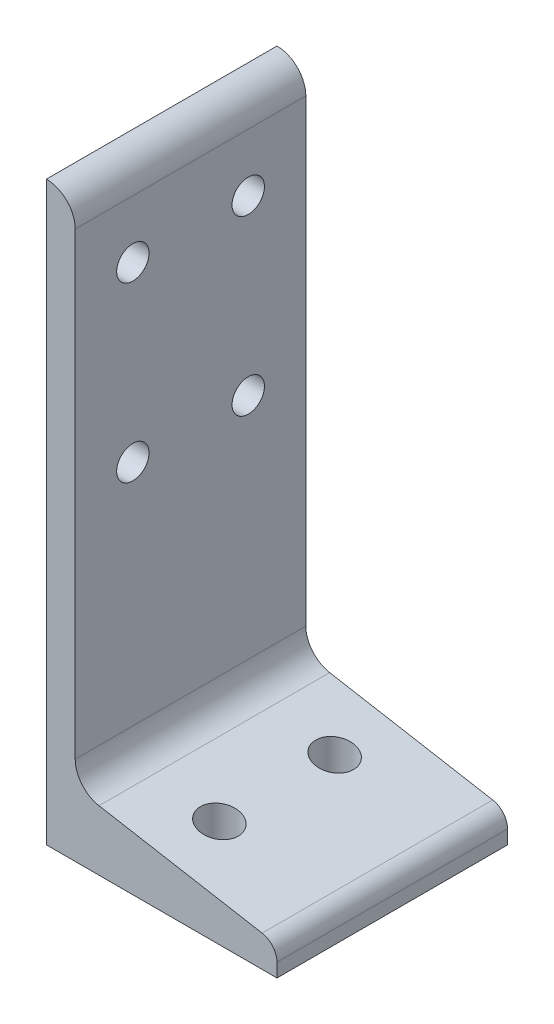
ISO-10303-21;
HEADER;
FILE_DESCRIPTION(('STEP AP214'),'2;1');
FILE_NAME('part.step','',(''),(''),'','','');
FILE_SCHEMA(('AUTOMOTIVE_DESIGN { 1 0 10303 214 1 1 1 1 }'));
ENDSEC;
DATA;
#1=APPLICATION_CONTEXT('core data for automotive mechanical design processes');
#2=APPLICATION_PROTOCOL_DEFINITION('international standard','automotive_design',2000,#1);
#3=PRODUCT_CONTEXT('',#1,'mechanical');
#4=PRODUCT('Part','Part','',(#3));
#5=PRODUCT_RELATED_PRODUCT_CATEGORY('part','',(#4));
#6=PRODUCT_DEFINITION_FORMATION('','',#4);
#7=PRODUCT_DEFINITION_CONTEXT('part definition',#1,'design');
#8=PRODUCT_DEFINITION('design','',#6,#7);
#9=PRODUCT_DEFINITION_SHAPE('','',#8);
#10=(LENGTH_UNIT() NAMED_UNIT(*) SI_UNIT(.MILLI.,.METRE.));
#11=(NAMED_UNIT(*) PLANE_ANGLE_UNIT() SI_UNIT($,.RADIAN.));
#12=(NAMED_UNIT(*) SI_UNIT($,.STERADIAN.) SOLID_ANGLE_UNIT());
#13=UNCERTAINTY_MEASURE_WITH_UNIT(LENGTH_MEASURE(1.E-05),#10,'distance_accuracy_value','');
#14=(GEOMETRIC_REPRESENTATION_CONTEXT(3) GLOBAL_UNCERTAINTY_ASSIGNED_CONTEXT((#13)) GLOBAL_UNIT_ASSIGNED_CONTEXT((#10,
#11,#12)) REPRESENTATION_CONTEXT('',''));
#15=CARTESIAN_POINT('',(0.,0.,0.));
#16=DIRECTION('',(0.,0.,1.));
#17=DIRECTION('',(1.,0.,0.));
#18=AXIS2_PLACEMENT_3D('',#15,#16,#17);
#19=CARTESIAN_POINT('',(-16.3878975119817,0.,50.8));
#20=DIRECTION('',(-1.,0.,0.));
#21=DIRECTION('',(0.,-1.,0.));
#22=AXIS2_PLACEMENT_3D('',#19,#20,#21);
#23=PLANE('',#22);
#24=CARTESIAN_POINT('',(-16.3878975119818,121.648995440178,12.6852380775335));
#25=DIRECTION('',(1.,0.,0.));
#26=DIRECTION('',(0.,1.,0.));
#27=AXIS2_PLACEMENT_3D('',#24,#25,#26);
#28=CIRCLE('',#27,3.56870000000001);
#29=CARTESIAN_POINT('',(-16.3878975119818,125.217695440178,12.6852380775335));
#30=VERTEX_POINT('',#29);
#31=EDGE_CURVE('E193',#30,#30,#28,.T.);
#32=ORIENTED_EDGE('',*,*,#31,.F.);
#33=EDGE_LOOP('',(#32));
#34=FACE_BOUND('',#33,.T.);
#35=CARTESIAN_POINT('',(-16.3878975119817,83.5489782815445,12.6852380775335));
#36=DIRECTION('',(1.,0.,0.));
#37=DIRECTION('',(0.,1.,0.));
#38=AXIS2_PLACEMENT_3D('',#35,#36,#37);
#39=CIRCLE('',#38,3.56869999999999);
#40=CARTESIAN_POINT('',(-16.3878975119817,87.1176782815445,12.6852380775335));
#41=VERTEX_POINT('',#40);
#42=EDGE_CURVE('E209',#41,#41,#39,.T.);
#43=ORIENTED_EDGE('',*,*,#42,.F.);
#44=EDGE_LOOP('',(#43));
#45=FACE_BOUND('',#44,.T.);
#46=CARTESIAN_POINT('',(-16.3878975119817,83.5489782815445,38.1));
#47=DIRECTION('',(1.,0.,0.));
#48=DIRECTION('',(0.,1.,0.));
#49=AXIS2_PLACEMENT_3D('',#46,#47,#48);
#50=CIRCLE('',#49,3.56869999999999);
#51=CARTESIAN_POINT('',(-16.3878975119817,87.1176782815445,38.1));
#52=VERTEX_POINT('',#51);
#53=EDGE_CURVE('E214',#52,#52,#50,.T.);
#54=ORIENTED_EDGE('',*,*,#53,.F.);
#55=EDGE_LOOP('',(#54));
#56=FACE_BOUND('',#55,.T.);
#57=CARTESIAN_POINT('',(-16.3878975119818,121.648978281545,38.1));
#58=DIRECTION('',(1.,0.,0.));
#59=DIRECTION('',(0.,1.,0.));
#60=AXIS2_PLACEMENT_3D('',#57,#58,#59);
#61=CIRCLE('',#60,3.56870000000002);
#62=CARTESIAN_POINT('',(-16.3878975119818,125.217678281545,38.1));
#63=VERTEX_POINT('',#62);
#64=EDGE_CURVE('E220',#63,#63,#61,.T.);
#65=ORIENTED_EDGE('',*,*,#64,.F.);
#66=EDGE_LOOP('',(#65));
#67=FACE_BOUND('',#66,.T.);
#68=DIRECTION('',(0.,1.,0.));
#69=VECTOR('',#68,1.);
#70=CARTESIAN_POINT('',(-16.3878975119817,0.,0.));
#71=LINE('',#70,#69);
#72=CARTESIAN_POINT('',(-16.3878975119817,33.2149952320115,0.));
#73=VERTEX_POINT('',#72);
#74=CARTESIAN_POINT('',(-16.3878975119818,134.348978281545,0.));
#75=VERTEX_POINT('',#74);
#76=EDGE_CURVE('E136',#73,#75,#71,.T.);
#77=ORIENTED_EDGE('',*,*,#76,.T.);
#78=DIRECTION('',(0.,0.,-1.));
#79=VECTOR('',#78,1.);
#80=CARTESIAN_POINT('',(-16.3878975119818,134.348978281545,50.8));
#81=LINE('',#80,#79);
#82=CARTESIAN_POINT('',(-16.3878975119818,134.348978281545,50.8));
#83=VERTEX_POINT('',#82);
#84=EDGE_CURVE('E11',#83,#75,#81,.T.);
#85=ORIENTED_EDGE('',*,*,#84,.F.);
#86=DIRECTION('',(0.,1.,0.));
#87=VECTOR('',#86,1.);
#88=CARTESIAN_POINT('',(-16.3878975119817,0.,50.8));
#89=LINE('',#88,#87);
#90=CARTESIAN_POINT('',(-16.3878975119817,33.2149952320115,50.8));
#91=VERTEX_POINT('',#90);
#92=EDGE_CURVE('E168',#91,#83,#89,.T.);
#93=ORIENTED_EDGE('',*,*,#92,.F.);
#94=DIRECTION('',(0.,0.,-1.));
#95=VECTOR('',#94,1.);
#96=CARTESIAN_POINT('',(-16.3878975119817,33.2149952320115,50.8));
#97=LINE('',#96,#95);
#98=EDGE_CURVE('E53',#91,#73,#97,.T.);
#99=ORIENTED_EDGE('',*,*,#98,.T.);
#100=EDGE_LOOP('',(#77,#85,#93,#99));
#101=FACE_BOUND('',#100,.T.);
#102=ADVANCED_FACE('F35',(#34,#45,#56,#67,#101),#23,.F.);
#103=CARTESIAN_POINT('',(-22.7378975119818,134.348978281545,50.8));
#104=DIRECTION('',(0.,0.,1.));
#105=DIRECTION('',(-1.,0.,0.));
#106=AXIS2_PLACEMENT_3D('',#103,#104,#105);
#107=ELLIPSE('',#106,6.35,6.34999999999999);
#108=DIRECTION('',(0.,0.,-1.));
#109=VECTOR('',#108,1.);
#110=SURFACE_OF_LINEAR_EXTRUSION('',#107,#109);
#111=CARTESIAN_POINT('',(-22.7378975119818,134.348978281545,0.));
#112=DIRECTION('',(0.,0.,1.));
#113=DIRECTION('',(-1.,0.,0.));
#114=AXIS2_PLACEMENT_3D('',#111,#112,#113);
#115=ELLIPSE('',#114,6.35,6.34999999999999);
#116=CARTESIAN_POINT('',(-22.7378975119817,140.698978281544,0.));
#117=VERTEX_POINT('',#116);
#118=EDGE_CURVE('E235',#75,#117,#115,.T.);
#119=ORIENTED_EDGE('',*,*,#118,.T.);
#120=DIRECTION('',(0.,0.,-1.));
#121=VECTOR('',#120,1.);
#122=CARTESIAN_POINT('',(-22.7378975119817,140.698978281544,50.8));
#123=LINE('',#122,#121);
#124=CARTESIAN_POINT('',(-22.7378975119817,140.698978281544,50.8));
#125=VERTEX_POINT('',#124);
#126=EDGE_CURVE('E44',#125,#117,#123,.T.);
#127=ORIENTED_EDGE('',*,*,#126,.F.);
#128=EDGE_CURVE('E92',#83,#125,#107,.T.);
#129=ORIENTED_EDGE('',*,*,#128,.F.);
#130=ORIENTED_EDGE('',*,*,#84,.T.);
#131=EDGE_LOOP('',(#119,#127,#129,#130));
#132=FACE_BOUND('',#131,.T.);
#133=ADVANCED_FACE('F160',(#132),#110,.F.);
#134=CARTESIAN_POINT('',(-22.7378975119817,0.,50.8));
#135=DIRECTION('',(1.,0.,0.));
#136=DIRECTION('',(0.,1.,0.));
#137=AXIS2_PLACEMENT_3D('',#134,#135,#136);
#138=PLANE('',#137);
#139=CARTESIAN_POINT('',(-22.7378975119818,121.648995440178,12.6852380775335));
#140=DIRECTION('',(1.,0.,0.));
#141=DIRECTION('',(0.,1.,0.));
#142=AXIS2_PLACEMENT_3D('',#139,#140,#141);
#143=CIRCLE('',#142,3.56870000000001);
#144=CARTESIAN_POINT('',(-22.7378975119818,125.217695440178,12.6852380775335));
#145=VERTEX_POINT('',#144);
#146=EDGE_CURVE('E198',#145,#145,#143,.T.);
#147=ORIENTED_EDGE('',*,*,#146,.T.);
#148=EDGE_LOOP('',(#147));
#149=FACE_BOUND('',#148,.T.);
#150=CARTESIAN_POINT('',(-22.7378975119818,83.5489782815445,12.6852380775335));
#151=DIRECTION('',(1.,0.,0.));
#152=DIRECTION('',(0.,1.,0.));
#153=AXIS2_PLACEMENT_3D('',#150,#151,#152);
#154=CIRCLE('',#153,3.56869999999999);
#155=CARTESIAN_POINT('',(-22.7378975119818,87.1176782815445,12.6852380775335));
#156=VERTEX_POINT('',#155);
#157=EDGE_CURVE('E211',#156,#156,#154,.T.);
#158=ORIENTED_EDGE('',*,*,#157,.T.);
#159=EDGE_LOOP('',(#158));
#160=FACE_BOUND('',#159,.T.);
#161=CARTESIAN_POINT('',(-22.7378975119818,83.5489782815445,38.1));
#162=DIRECTION('',(1.,0.,0.));
#163=DIRECTION('',(0.,1.,0.));
#164=AXIS2_PLACEMENT_3D('',#161,#162,#163);
#165=CIRCLE('',#164,3.56869999999999);
#166=CARTESIAN_POINT('',(-22.7378975119818,87.1176782815445,38.1));
#167=VERTEX_POINT('',#166);
#168=EDGE_CURVE('E217',#167,#167,#165,.T.);
#169=ORIENTED_EDGE('',*,*,#168,.T.);
#170=EDGE_LOOP('',(#169));
#171=FACE_BOUND('',#170,.T.);
#172=CARTESIAN_POINT('',(-22.7378975119818,121.648978281545,38.1));
#173=DIRECTION('',(1.,0.,0.));
#174=DIRECTION('',(0.,1.,0.));
#175=AXIS2_PLACEMENT_3D('',#172,#173,#174);
#176=CIRCLE('',#175,3.56870000000002);
#177=CARTESIAN_POINT('',(-22.7378975119818,125.217678281545,38.1));
#178=VERTEX_POINT('',#177);
#179=EDGE_CURVE('E223',#178,#178,#176,.T.);
#180=ORIENTED_EDGE('',*,*,#179,.T.);
#181=EDGE_LOOP('',(#180));
#182=FACE_BOUND('',#181,.T.);
#183=DIRECTION('',(0.,-1.,0.));
#184=VECTOR('',#183,1.);
#185=CARTESIAN_POINT('',(-22.7378975119817,0.,0.));
#186=LINE('',#185,#184);
#187=CARTESIAN_POINT('',(-22.7378975119817,13.6989782815445,0.));
#188=VERTEX_POINT('',#187);
#189=EDGE_CURVE('E236',#117,#188,#186,.T.);
#190=ORIENTED_EDGE('',*,*,#189,.T.);
#191=DIRECTION('',(0.,0.,-1.));
#192=VECTOR('',#191,1.);
#193=CARTESIAN_POINT('',(-22.7378975119817,13.6989782815445,50.8));
#194=LINE('',#193,#192);
#195=CARTESIAN_POINT('',(-22.7378975119817,13.6989782815445,50.8));
#196=VERTEX_POINT('',#195);
#197=EDGE_CURVE('E183',#196,#188,#194,.T.);
#198=ORIENTED_EDGE('',*,*,#197,.F.);
#199=DIRECTION('',(0.,-1.,0.));
#200=VECTOR('',#199,1.);
#201=CARTESIAN_POINT('',(-22.7378975119817,0.,50.8));
#202=LINE('',#201,#200);
#203=EDGE_CURVE('E167',#125,#196,#202,.T.);
#204=ORIENTED_EDGE('',*,*,#203,.F.);
#205=ORIENTED_EDGE('',*,*,#126,.T.);
#206=EDGE_LOOP('',(#190,#198,#204,#205));
#207=FACE_BOUND('',#206,.T.);
#208=ADVANCED_FACE('F157',(#149,#160,#171,#182,#207),#138,.F.);
#209=CARTESIAN_POINT('',(0.,13.6989782815445,50.8));
#210=DIRECTION('',(0.,1.,0.));
#211=DIRECTION('',(-1.,0.,0.));
#212=AXIS2_PLACEMENT_3D('',#209,#210,#211);
#213=PLANE('',#212);
#214=CARTESIAN_POINT('',(2.66210248801829,13.6989782815445,38.1));
#215=DIRECTION('',(0.,-1.,0.));
#216=DIRECTION('',(1.,0.,0.));
#217=AXIS2_PLACEMENT_3D('',#214,#215,#216);
#218=CIRCLE('',#217,4.1656);
#219=CARTESIAN_POINT('',(6.82770248801829,13.6989782815445,38.1));
#220=VERTEX_POINT('',#219);
#221=EDGE_CURVE('E205',#220,#220,#218,.T.);
#222=ORIENTED_EDGE('',*,*,#221,.F.);
#223=EDGE_LOOP('',(#222));
#224=FACE_BOUND('',#223,.T.);
#225=CARTESIAN_POINT('',(2.66210248801829,13.6989782815445,12.7));
#226=DIRECTION('',(0.,-1.,0.));
#227=DIRECTION('',(1.,0.,0.));
#228=AXIS2_PLACEMENT_3D('',#225,#226,#227);
#229=CIRCLE('',#228,4.1656);
#230=CARTESIAN_POINT('',(6.82770248801829,13.6989782815445,12.7));
#231=VERTEX_POINT('',#230);
#232=EDGE_CURVE('E194',#231,#231,#229,.T.);
#233=ORIENTED_EDGE('',*,*,#232,.F.);
#234=EDGE_LOOP('',(#233));
#235=FACE_BOUND('',#234,.T.);
#236=DIRECTION('',(1.,0.,0.));
#237=VECTOR('',#236,1.);
#238=CARTESIAN_POINT('',(0.,13.6989782815445,0.));
#239=LINE('',#238,#237);
#240=CARTESIAN_POINT('',(28.0621024880183,13.6989782815445,0.));
#241=VERTEX_POINT('',#240);
#242=EDGE_CURVE('E181',#188,#241,#239,.T.);
#243=ORIENTED_EDGE('',*,*,#242,.T.);
#244=DIRECTION('',(0.,0.,-1.));
#245=VECTOR('',#244,1.);
#246=CARTESIAN_POINT('',(28.0621024880183,13.6989782815445,50.8));
#247=LINE('',#246,#245);
#248=CARTESIAN_POINT('',(28.0621024880183,13.6989782815445,50.8));
#249=VERTEX_POINT('',#248);
#250=EDGE_CURVE('E179',#249,#241,#247,.T.);
#251=ORIENTED_EDGE('',*,*,#250,.F.);
#252=DIRECTION('',(1.,0.,0.));
#253=VECTOR('',#252,1.);
#254=CARTESIAN_POINT('',(0.,13.6989782815445,50.8));
#255=LINE('',#254,#253);
#256=EDGE_CURVE('E171',#196,#249,#255,.T.);
#257=ORIENTED_EDGE('',*,*,#256,.F.);
#258=ORIENTED_EDGE('',*,*,#197,.T.);
#259=EDGE_LOOP('',(#243,#251,#257,#258));
#260=FACE_BOUND('',#259,.T.);
#261=ADVANCED_FACE('F153',(#224,#235,#260),#213,.F.);
#262=CARTESIAN_POINT('',(28.0621024880183,0.,50.8));
#263=DIRECTION('',(-1.,0.,0.));
#264=DIRECTION('',(0.,-1.,0.));
#265=AXIS2_PLACEMENT_3D('',#262,#263,#264);
#266=PLANE('',#265);
#267=DIRECTION('',(0.,1.,0.));
#268=VECTOR('',#267,1.);
#269=CARTESIAN_POINT('',(28.0621024880183,0.,0.));
#270=LINE('',#269,#268);
#271=CARTESIAN_POINT('',(28.0621024880183,16.7241299029677,0.));
#272=VERTEX_POINT('',#271);
#273=EDGE_CURVE('E185',#241,#272,#270,.T.);
#274=ORIENTED_EDGE('',*,*,#273,.T.);
#275=DIRECTION('',(0.,0.,-1.));
#276=VECTOR('',#275,1.);
#277=CARTESIAN_POINT('',(28.0621024880183,16.7241299029677,50.8));
#278=LINE('',#277,#276);
#279=CARTESIAN_POINT('',(28.0621024880183,16.7241299029677,50.8));
#280=VERTEX_POINT('',#279);
#281=EDGE_CURVE('E126',#280,#272,#278,.T.);
#282=ORIENTED_EDGE('',*,*,#281,.F.);
#283=DIRECTION('',(0.,1.,0.));
#284=VECTOR('',#283,1.);
#285=CARTESIAN_POINT('',(28.0621024880183,0.,50.8));
#286=LINE('',#285,#284);
#287=EDGE_CURVE('E114',#249,#280,#286,.T.);
#288=ORIENTED_EDGE('',*,*,#287,.F.);
#289=ORIENTED_EDGE('',*,*,#250,.T.);
#290=EDGE_LOOP('',(#274,#282,#288,#289));
#291=FACE_BOUND('',#290,.T.);
#292=ADVANCED_FACE('F150',(#291),#266,.F.);
#293=CARTESIAN_POINT('',(24.0997024880183,16.7241299029677,50.8));
#294=DIRECTION('',(0.,0.,1.));
#295=DIRECTION('',(1.,0.,0.));
#296=AXIS2_PLACEMENT_3D('',#293,#294,#295);
#297=ELLIPSE('',#296,3.9624,3.9624);
#298=DIRECTION('',(0.,0.,-1.));
#299=VECTOR('',#298,1.);
#300=SURFACE_OF_LINEAR_EXTRUSION('',#297,#299);
#301=CARTESIAN_POINT('',(24.0997024880183,16.7241299029677,0.));
#302=DIRECTION('',(0.,0.,1.));
#303=DIRECTION('',(1.,0.,0.));
#304=AXIS2_PLACEMENT_3D('',#301,#302,#303);
#305=ELLIPSE('',#304,3.9624,3.9624);
#306=CARTESIAN_POINT('',(24.7877660272057,20.6263321435033,0.));
#307=VERTEX_POINT('',#306);
#308=EDGE_CURVE('E123',#272,#307,#305,.T.);
#309=ORIENTED_EDGE('',*,*,#308,.T.);
#310=DIRECTION('',(0.,0.,-1.));
#311=VECTOR('',#310,1.);
#312=CARTESIAN_POINT('',(24.7877660272057,20.6263321435033,50.8));
#313=LINE('',#312,#311);
#314=CARTESIAN_POINT('',(24.7877660272057,20.6263321435033,50.8));
#315=VERTEX_POINT('',#314);
#316=EDGE_CURVE('E120',#315,#307,#313,.T.);
#317=ORIENTED_EDGE('',*,*,#316,.F.);
#318=EDGE_CURVE('E107',#280,#315,#297,.T.);
#319=ORIENTED_EDGE('',*,*,#318,.F.);
#320=ORIENTED_EDGE('',*,*,#281,.T.);
#321=EDGE_LOOP('',(#309,#317,#319,#320));
#322=FACE_BOUND('',#321,.T.);
#323=ADVANCED_FACE('F121',(#322),#300,.F.);
#324=CARTESIAN_POINT('',(4.27475314083834,24.2433297709902,50.8));
#325=DIRECTION('',(-0.17364817766693,-0.984807753012208,0.));
#326=DIRECTION('',(0.984807753012208,-0.17364817766693,0.));
#327=AXIS2_PLACEMENT_3D('',#324,#325,#326);
#328=PLANE('',#327);
#329=CARTESIAN_POINT('',(2.66210248801829,24.5276835915395,38.1));
#330=DIRECTION('',(-0.17364817766693,-0.984807753012208,0.));
#331=DIRECTION('',(0.984807753012208,-0.17364817766693,0.));
#332=AXIS2_PLACEMENT_3D('',#329,#330,#331);
#333=ELLIPSE('',#332,4.22986109447126,4.1656);
#334=CARTESIAN_POINT('',(6.82770248801829,23.7931759207004,38.1));
#335=VERTEX_POINT('',#334);
#336=EDGE_CURVE('E38',#335,#335,#333,.T.);
#337=ORIENTED_EDGE('',*,*,#336,.T.);
#338=EDGE_LOOP('',(#337));
#339=FACE_BOUND('',#338,.T.);
#340=CARTESIAN_POINT('',(2.66210248801829,24.5276835915395,12.7));
#341=DIRECTION('',(-0.17364817766693,-0.984807753012208,0.));
#342=DIRECTION('',(0.984807753012208,-0.17364817766693,0.));
#343=AXIS2_PLACEMENT_3D('',#340,#341,#342);
#344=ELLIPSE('',#343,4.22986109447126,4.1656);
#345=CARTESIAN_POINT('',(6.82770248801829,23.7931759207004,12.7));
#346=VERTEX_POINT('',#345);
#347=EDGE_CURVE('E191',#346,#346,#344,.T.);
#348=ORIENTED_EDGE('',*,*,#347,.T.);
#349=EDGE_LOOP('',(#348));
#350=FACE_BOUND('',#349,.T.);
#351=DIRECTION('',(-0.984807753012208,0.17364817766693,0.));
#352=VECTOR('',#351,1.);
#353=CARTESIAN_POINT('',(4.27475314083834,24.2433297709902,0.));
#354=LINE('',#353,#352);
#355=CARTESIAN_POINT('',(-11.1405634401667,26.961466000384,0.));
#356=VERTEX_POINT('',#355);
#357=EDGE_CURVE('E242',#307,#356,#354,.T.);
#358=ORIENTED_EDGE('',*,*,#357,.T.);
#359=DIRECTION('',(0.,0.,-1.));
#360=VECTOR('',#359,1.);
#361=CARTESIAN_POINT('',(-11.1405634401667,26.961466000384,50.8));
#362=LINE('',#361,#360);
#363=CARTESIAN_POINT('',(-11.1405634401667,26.961466000384,50.8));
#364=VERTEX_POINT('',#363);
#365=EDGE_CURVE('E80',#364,#356,#362,.T.);
#366=ORIENTED_EDGE('',*,*,#365,.F.);
#367=DIRECTION('',(-0.984807753012208,0.17364817766693,0.));
#368=VECTOR('',#367,1.);
#369=CARTESIAN_POINT('',(4.27475314083834,24.2433297709902,50.8));
#370=LINE('',#369,#368);
#371=EDGE_CURVE('E112',#315,#364,#370,.T.);
#372=ORIENTED_EDGE('',*,*,#371,.F.);
#373=ORIENTED_EDGE('',*,*,#316,.T.);
#374=EDGE_LOOP('',(#358,#366,#372,#373));
#375=FACE_BOUND('',#374,.T.);
#376=ADVANCED_FACE('F128',(#339,#350,#375),#328,.F.);
#377=CARTESIAN_POINT('',(-10.0378975119817,33.2149952320115,50.8));
#378=DIRECTION('',(0.,0.,1.));
#379=DIRECTION('',(0.,1.,0.));
#380=AXIS2_PLACEMENT_3D('',#377,#378,#379);
#381=ELLIPSE('',#380,6.35,6.35);
#382=DIRECTION('',(0.,0.,-1.));
#383=VECTOR('',#382,1.);
#384=SURFACE_OF_LINEAR_EXTRUSION('',#381,#383);
#385=CARTESIAN_POINT('',(-10.0378975119817,33.2149952320115,0.));
#386=DIRECTION('',(0.,0.,1.));
#387=DIRECTION('',(0.,1.,0.));
#388=AXIS2_PLACEMENT_3D('',#385,#386,#387);
#389=ELLIPSE('',#388,6.35,6.35);
#390=EDGE_CURVE('E244',#73,#356,#389,.T.);
#391=ORIENTED_EDGE('',*,*,#390,.F.);
#392=ORIENTED_EDGE('',*,*,#98,.F.);
#393=EDGE_CURVE('E129',#91,#364,#381,.T.);
#394=ORIENTED_EDGE('',*,*,#393,.T.);
#395=ORIENTED_EDGE('',*,*,#365,.T.);
#396=EDGE_LOOP('',(#391,#392,#394,#395));
#397=FACE_BOUND('',#396,.T.);
#398=ADVANCED_FACE('F139',(#397),#384,.T.);
#399=CARTESIAN_POINT('',(0.,0.,50.8));
#400=DIRECTION('',(0.,0.,1.));
#401=DIRECTION('',(1.,0.,0.));
#402=AXIS2_PLACEMENT_3D('',#399,#400,#401);
#403=PLANE('',#402);
#404=ORIENTED_EDGE('',*,*,#92,.T.);
#405=ORIENTED_EDGE('',*,*,#128,.T.);
#406=ORIENTED_EDGE('',*,*,#203,.T.);
#407=ORIENTED_EDGE('',*,*,#256,.T.);
#408=ORIENTED_EDGE('',*,*,#287,.T.);
#409=ORIENTED_EDGE('',*,*,#318,.T.);
#410=ORIENTED_EDGE('',*,*,#371,.T.);
#411=ORIENTED_EDGE('',*,*,#393,.F.);
#412=EDGE_LOOP('',(#404,#405,#406,#407,#408,#409,#410,#411));
#413=FACE_BOUND('',#412,.T.);
#414=ADVANCED_FACE('F109',(#413),#403,.T.);
#415=CARTESIAN_POINT('',(0.,0.,0.));
#416=DIRECTION('',(0.,0.,1.));
#417=DIRECTION('',(1.,0.,0.));
#418=AXIS2_PLACEMENT_3D('',#415,#416,#417);
#419=PLANE('',#418);
#420=ORIENTED_EDGE('',*,*,#76,.F.);
#421=ORIENTED_EDGE('',*,*,#390,.T.);
#422=ORIENTED_EDGE('',*,*,#357,.F.);
#423=ORIENTED_EDGE('',*,*,#308,.F.);
#424=ORIENTED_EDGE('',*,*,#273,.F.);
#425=ORIENTED_EDGE('',*,*,#242,.F.);
#426=ORIENTED_EDGE('',*,*,#189,.F.);
#427=ORIENTED_EDGE('',*,*,#118,.F.);
#428=EDGE_LOOP('',(#420,#421,#422,#423,#424,#425,#426,#427));
#429=FACE_BOUND('',#428,.T.);
#430=ADVANCED_FACE('F143',(#429),#419,.F.);
#431=CARTESIAN_POINT('',(-22.7378975119818,121.648978281545,38.1));
#432=DIRECTION('',(1.,0.,0.));
#433=DIRECTION('',(0.,1.,0.));
#434=AXIS2_PLACEMENT_3D('',#431,#432,#433);
#435=CYLINDRICAL_SURFACE('',#434,3.56870000000002);
#436=ORIENTED_EDGE('',*,*,#179,.F.);
#437=EDGE_LOOP('',(#436));
#438=FACE_BOUND('',#437,.T.);
#439=ORIENTED_EDGE('',*,*,#64,.T.);
#440=EDGE_LOOP('',(#439));
#441=FACE_BOUND('',#440,.T.);
#442=ADVANCED_FACE('F228',(#438,#441),#435,.F.);
#443=CARTESIAN_POINT('',(-22.7378975119818,83.5489782815445,38.1));
#444=DIRECTION('',(1.,0.,0.));
#445=DIRECTION('',(0.,1.,0.));
#446=AXIS2_PLACEMENT_3D('',#443,#444,#445);
#447=CYLINDRICAL_SURFACE('',#446,3.56869999999999);
#448=ORIENTED_EDGE('',*,*,#168,.F.);
#449=EDGE_LOOP('',(#448));
#450=FACE_BOUND('',#449,.T.);
#451=ORIENTED_EDGE('',*,*,#53,.T.);
#452=EDGE_LOOP('',(#451));
#453=FACE_BOUND('',#452,.T.);
#454=ADVANCED_FACE('F253',(#450,#453),#447,.F.);
#455=CARTESIAN_POINT('',(-22.7378975119818,83.5489782815445,12.6852380775335));
#456=DIRECTION('',(1.,0.,0.));
#457=DIRECTION('',(0.,1.,0.));
#458=AXIS2_PLACEMENT_3D('',#455,#456,#457);
#459=CYLINDRICAL_SURFACE('',#458,3.56869999999999);
#460=ORIENTED_EDGE('',*,*,#157,.F.);
#461=EDGE_LOOP('',(#460));
#462=FACE_BOUND('',#461,.T.);
#463=ORIENTED_EDGE('',*,*,#42,.T.);
#464=EDGE_LOOP('',(#463));
#465=FACE_BOUND('',#464,.T.);
#466=ADVANCED_FACE('F261',(#462,#465),#459,.F.);
#467=CARTESIAN_POINT('',(-22.7378975119818,121.648995440178,12.6852380775335));
#468=DIRECTION('',(1.,0.,0.));
#469=DIRECTION('',(0.,1.,0.));
#470=AXIS2_PLACEMENT_3D('',#467,#468,#469);
#471=CYLINDRICAL_SURFACE('',#470,3.56870000000001);
#472=ORIENTED_EDGE('',*,*,#146,.F.);
#473=EDGE_LOOP('',(#472));
#474=FACE_BOUND('',#473,.T.);
#475=ORIENTED_EDGE('',*,*,#31,.T.);
#476=EDGE_LOOP('',(#475));
#477=FACE_BOUND('',#476,.T.);
#478=ADVANCED_FACE('F265',(#474,#477),#471,.F.);
#479=CARTESIAN_POINT('',(2.66210248801824,140.698978281544,12.7));
#480=DIRECTION('',(0.,-1.,0.));
#481=DIRECTION('',(1.,0.,0.));
#482=AXIS2_PLACEMENT_3D('',#479,#480,#481);
#483=CYLINDRICAL_SURFACE('',#482,4.1656);
#484=ORIENTED_EDGE('',*,*,#232,.T.);
#485=EDGE_LOOP('',(#484));
#486=FACE_BOUND('',#485,.T.);
#487=ORIENTED_EDGE('',*,*,#347,.F.);
#488=EDGE_LOOP('',(#487));
#489=FACE_BOUND('',#488,.T.);
#490=ADVANCED_FACE('F269',(#486,#489),#483,.F.);
#491=CARTESIAN_POINT('',(2.66210248801824,140.698978281544,38.1));
#492=DIRECTION('',(0.,-1.,0.));
#493=DIRECTION('',(1.,0.,0.));
#494=AXIS2_PLACEMENT_3D('',#491,#492,#493);
#495=CYLINDRICAL_SURFACE('',#494,4.1656);
#496=ORIENTED_EDGE('',*,*,#221,.T.);
#497=EDGE_LOOP('',(#496));
#498=FACE_BOUND('',#497,.T.);
#499=ORIENTED_EDGE('',*,*,#336,.F.);
#500=EDGE_LOOP('',(#499));
#501=FACE_BOUND('',#500,.T.);
#502=ADVANCED_FACE('F273',(#498,#501),#495,.F.);
#503=CLOSED_SHELL('',(#102,#133,#208,#261,#292,#323,#376,#398,#414,#430,#442,#454,#466,#478,
#490,#502));
#504=MANIFOLD_SOLID_BREP('B2',#503);
#505=ADVANCED_BREP_SHAPE_REPRESENTATION('',(#18,#504),#14);
#506=SHAPE_DEFINITION_REPRESENTATION(#9,#505);
ENDSEC;
END-ISO-10303-21;
